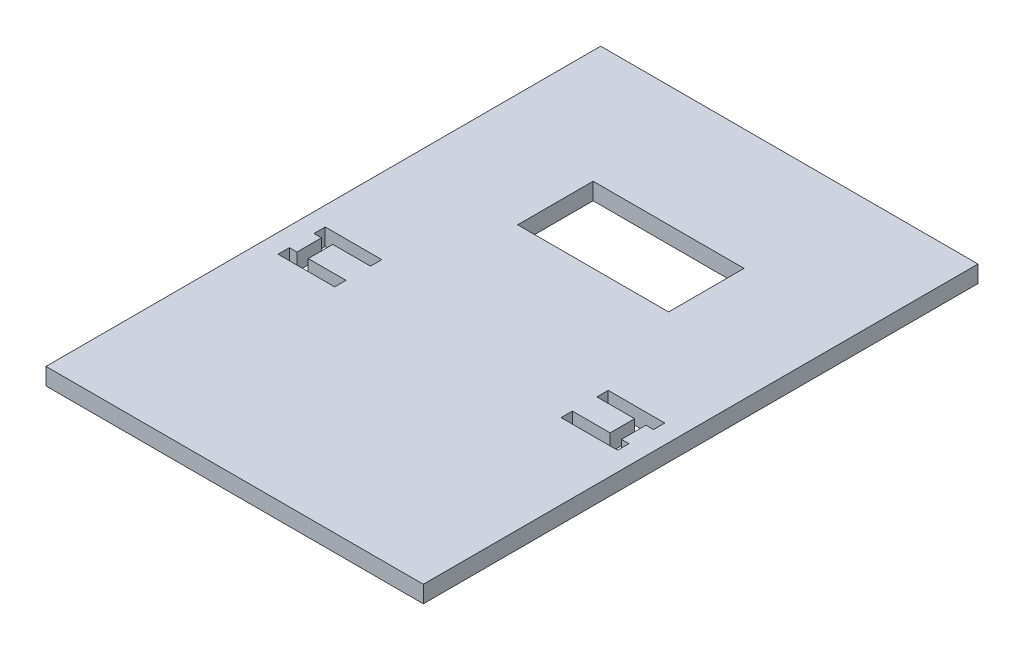
ISO-10303-21;
HEADER;
FILE_DESCRIPTION(('STEP AP214'),'2;1');
FILE_NAME('part.step','',(''),(''),'','','');
FILE_SCHEMA(('AUTOMOTIVE_DESIGN { 1 0 10303 214 1 1 1 1 }'));
ENDSEC;
DATA;
#1=APPLICATION_CONTEXT('core data for automotive mechanical design processes');
#2=APPLICATION_PROTOCOL_DEFINITION('international standard','automotive_design',2000,#1);
#3=PRODUCT_CONTEXT('',#1,'mechanical');
#4=PRODUCT('Part','Part','',(#3));
#5=PRODUCT_RELATED_PRODUCT_CATEGORY('part','',(#4));
#6=PRODUCT_DEFINITION_FORMATION('','',#4);
#7=PRODUCT_DEFINITION_CONTEXT('part definition',#1,'design');
#8=PRODUCT_DEFINITION('design','',#6,#7);
#9=PRODUCT_DEFINITION_SHAPE('','',#8);
#10=(LENGTH_UNIT() NAMED_UNIT(*) SI_UNIT(.MILLI.,.METRE.));
#11=(NAMED_UNIT(*) PLANE_ANGLE_UNIT() SI_UNIT($,.RADIAN.));
#12=(NAMED_UNIT(*) SI_UNIT($,.STERADIAN.) SOLID_ANGLE_UNIT());
#13=UNCERTAINTY_MEASURE_WITH_UNIT(LENGTH_MEASURE(1.E-05),#10,'distance_accuracy_value','');
#14=(GEOMETRIC_REPRESENTATION_CONTEXT(3) GLOBAL_UNCERTAINTY_ASSIGNED_CONTEXT((#13)) GLOBAL_UNIT_ASSIGNED_CONTEXT((#10,
#11,#12)) REPRESENTATION_CONTEXT('',''));
#15=CARTESIAN_POINT('',(0.,0.,0.));
#16=DIRECTION('',(0.,0.,1.));
#17=DIRECTION('',(1.,0.,0.));
#18=AXIS2_PLACEMENT_3D('',#15,#16,#17);
#19=CARTESIAN_POINT('',(0.,4.5,0.));
#20=DIRECTION('',(0.,-1.,0.));
#21=DIRECTION('',(0.,0.,-1.));
#22=AXIS2_PLACEMENT_3D('',#19,#20,#21);
#23=PLANE('',#22);
#24=DIRECTION('',(-1.,0.,0.));
#25=VECTOR('',#24,1.);
#26=CARTESIAN_POINT('',(-20.,4.5,-39.0292439198747));
#27=LINE('',#26,#25);
#28=CARTESIAN_POINT('',(20.,4.5,-39.0292439198747));
#29=VERTEX_POINT('',#28);
#30=CARTESIAN_POINT('',(-20.,4.5,-39.0292439198747));
#31=VERTEX_POINT('',#30);
#32=EDGE_CURVE('E340',#29,#31,#27,.T.);
#33=ORIENTED_EDGE('',*,*,#32,.F.);
#34=DIRECTION('',(0.,0.,-1.));
#35=VECTOR('',#34,1.);
#36=CARTESIAN_POINT('',(20.,4.5,-39.0292439198747));
#37=LINE('',#36,#35);
#38=CARTESIAN_POINT('',(20.,4.5,-19.0292439198747));
#39=VERTEX_POINT('',#38);
#40=EDGE_CURVE('E348',#39,#29,#37,.T.);
#41=ORIENTED_EDGE('',*,*,#40,.F.);
#42=DIRECTION('',(1.,0.,0.));
#43=VECTOR('',#42,1.);
#44=CARTESIAN_POINT('',(20.,4.5,-19.0292439198747));
#45=LINE('',#44,#43);
#46=CARTESIAN_POINT('',(-20.,4.5,-19.0292439198747));
#47=VERTEX_POINT('',#46);
#48=EDGE_CURVE('E345',#47,#39,#45,.T.);
#49=ORIENTED_EDGE('',*,*,#48,.F.);
#50=DIRECTION('',(0.,0.,1.));
#51=VECTOR('',#50,1.);
#52=CARTESIAN_POINT('',(-20.,4.5,-19.0292439198747));
#53=LINE('',#52,#51);
#54=EDGE_CURVE('E342',#31,#47,#53,.T.);
#55=ORIENTED_EDGE('',*,*,#54,.F.);
#56=EDGE_LOOP('',(#33,#41,#49,#55));
#57=FACE_BOUND('',#56,.T.);
#58=DIRECTION('',(0.,0.,-1.));
#59=VECTOR('',#58,1.);
#60=CARTESIAN_POINT('',(50.,4.5,-71.0292439198747));
#61=LINE('',#60,#59);
#62=CARTESIAN_POINT('',(50.,4.5,75.9707560801253));
#63=VERTEX_POINT('',#62);
#64=CARTESIAN_POINT('',(50.,4.5,-71.0292439198747));
#65=VERTEX_POINT('',#64);
#66=EDGE_CURVE('E458',#63,#65,#61,.T.);
#67=ORIENTED_EDGE('',*,*,#66,.T.);
#68=DIRECTION('',(-1.,0.,0.));
#69=VECTOR('',#68,1.);
#70=CARTESIAN_POINT('',(50.,4.5,-71.0292439198747));
#71=LINE('',#70,#69);
#72=CARTESIAN_POINT('',(-50.,4.5,-71.0292439198747));
#73=VERTEX_POINT('',#72);
#74=EDGE_CURVE('E461',#65,#73,#71,.T.);
#75=ORIENTED_EDGE('',*,*,#74,.T.);
#76=DIRECTION('',(0.,0.,1.));
#77=VECTOR('',#76,1.);
#78=CARTESIAN_POINT('',(-50.,4.5,75.9707560801253));
#79=LINE('',#78,#77);
#80=CARTESIAN_POINT('',(-50.,4.5,75.9707560801253));
#81=VERTEX_POINT('',#80);
#82=EDGE_CURVE('E464',#73,#81,#79,.T.);
#83=ORIENTED_EDGE('',*,*,#82,.T.);
#84=DIRECTION('',(1.,0.,0.));
#85=VECTOR('',#84,1.);
#86=CARTESIAN_POINT('',(50.,4.5,75.9707560801253));
#87=LINE('',#86,#85);
#88=EDGE_CURVE('E466',#81,#63,#87,.T.);
#89=ORIENTED_EDGE('',*,*,#88,.T.);
#90=EDGE_LOOP('',(#67,#75,#83,#89));
#91=FACE_BOUND('',#90,.T.);
#92=DIRECTION('',(0.,0.,1.));
#93=VECTOR('',#92,1.);
#94=CARTESIAN_POINT('',(-45.,4.5,9.97075608012532));
#95=LINE('',#94,#93);
#96=CARTESIAN_POINT('',(-45.,4.5,6.97075608012532));
#97=VERTEX_POINT('',#96);
#98=CARTESIAN_POINT('',(-45.,4.5,9.97075608012532));
#99=VERTEX_POINT('',#98);
#100=EDGE_CURVE('E371',#97,#99,#95,.T.);
#101=ORIENTED_EDGE('',*,*,#100,.F.);
#102=DIRECTION('',(-1.,0.,0.));
#103=VECTOR('',#102,1.);
#104=CARTESIAN_POINT('',(-45.,4.5,6.97075608012532));
#105=LINE('',#104,#103);
#106=CARTESIAN_POINT('',(-30.,4.5,6.97075608012532));
#107=VERTEX_POINT('',#106);
#108=EDGE_CURVE('E395',#107,#97,#105,.T.);
#109=ORIENTED_EDGE('',*,*,#108,.F.);
#110=DIRECTION('',(0.,0.,-1.));
#111=VECTOR('',#110,1.);
#112=CARTESIAN_POINT('',(-30.,4.5,6.97075608012532));
#113=LINE('',#112,#111);
#114=CARTESIAN_POINT('',(-30.,4.5,9.97075608012532));
#115=VERTEX_POINT('',#114);
#116=EDGE_CURVE('E392',#115,#107,#113,.T.);
#117=ORIENTED_EDGE('',*,*,#116,.F.);
#118=DIRECTION('',(1.,0.,0.));
#119=VECTOR('',#118,1.);
#120=CARTESIAN_POINT('',(-30.,4.5,9.97075608012532));
#121=LINE('',#120,#119);
#122=CARTESIAN_POINT('',(-40.,4.5,9.97075608012532));
#123=VERTEX_POINT('',#122);
#124=EDGE_CURVE('E390',#123,#115,#121,.T.);
#125=ORIENTED_EDGE('',*,*,#124,.F.);
#126=DIRECTION('',(0.,0.,-1.));
#127=VECTOR('',#126,1.);
#128=CARTESIAN_POINT('',(-40.,4.5,9.97075608012532));
#129=LINE('',#128,#127);
#130=CARTESIAN_POINT('',(-40.,4.5,16.4707560801253));
#131=VERTEX_POINT('',#130);
#132=EDGE_CURVE('E388',#131,#123,#129,.T.);
#133=ORIENTED_EDGE('',*,*,#132,.F.);
#134=DIRECTION('',(-1.,0.,0.));
#135=VECTOR('',#134,1.);
#136=CARTESIAN_POINT('',(-40.,4.5,16.4707560801253));
#137=LINE('',#136,#135);
#138=CARTESIAN_POINT('',(-30.,4.5,16.4707560801253));
#139=VERTEX_POINT('',#138);
#140=EDGE_CURVE('E386',#139,#131,#137,.T.);
#141=ORIENTED_EDGE('',*,*,#140,.F.);
#142=DIRECTION('',(0.,0.,-1.));
#143=VECTOR('',#142,1.);
#144=CARTESIAN_POINT('',(-30.,4.5,16.4707560801253));
#145=LINE('',#144,#143);
#146=CARTESIAN_POINT('',(-30.,4.5,19.4707560801253));
#147=VERTEX_POINT('',#146);
#148=EDGE_CURVE('E384',#147,#139,#145,.T.);
#149=ORIENTED_EDGE('',*,*,#148,.F.);
#150=DIRECTION('',(1.,0.,0.));
#151=VECTOR('',#150,1.);
#152=CARTESIAN_POINT('',(-30.,4.5,19.4707560801253));
#153=LINE('',#152,#151);
#154=CARTESIAN_POINT('',(-45.,4.5,19.4707560801253));
#155=VERTEX_POINT('',#154);
#156=EDGE_CURVE('E382',#155,#147,#153,.T.);
#157=ORIENTED_EDGE('',*,*,#156,.F.);
#158=DIRECTION('',(0.,0.,1.));
#159=VECTOR('',#158,1.);
#160=CARTESIAN_POINT('',(-45.,4.5,19.4707560801253));
#161=LINE('',#160,#159);
#162=CARTESIAN_POINT('',(-44.9999999999999,4.5,16.4707560801253));
#163=VERTEX_POINT('',#162);
#164=EDGE_CURVE('E380',#163,#155,#161,.T.);
#165=ORIENTED_EDGE('',*,*,#164,.F.);
#166=DIRECTION('',(-1.,0.,0.));
#167=VECTOR('',#166,1.);
#168=CARTESIAN_POINT('',(-44.9999999999999,4.5,16.4707560801253));
#169=LINE('',#168,#167);
#170=CARTESIAN_POINT('',(-43.,4.5,16.4707560801253));
#171=VERTEX_POINT('',#170);
#172=EDGE_CURVE('E378',#171,#163,#169,.T.);
#173=ORIENTED_EDGE('',*,*,#172,.F.);
#174=DIRECTION('',(0.,0.,1.));
#175=VECTOR('',#174,1.);
#176=CARTESIAN_POINT('',(-43.,4.5,16.4707560801253));
#177=LINE('',#176,#175);
#178=CARTESIAN_POINT('',(-43.,4.5,9.97075608012532));
#179=VERTEX_POINT('',#178);
#180=EDGE_CURVE('E376',#179,#171,#177,.T.);
#181=ORIENTED_EDGE('',*,*,#180,.F.);
#182=DIRECTION('',(1.,0.,0.));
#183=VECTOR('',#182,1.);
#184=CARTESIAN_POINT('',(-43.,4.5,9.97075608012532));
#185=LINE('',#184,#183);
#186=EDGE_CURVE('E373',#99,#179,#185,.T.);
#187=ORIENTED_EDGE('',*,*,#186,.F.);
#188=EDGE_LOOP('',(#101,#109,#117,#125,#133,#141,#149,#157,#165,#173,#181,#187));
#189=FACE_BOUND('',#188,.T.);
#190=DIRECTION('',(0.,0.,-1.));
#191=VECTOR('',#190,1.);
#192=CARTESIAN_POINT('',(43.,4.5,16.4707560801253));
#193=LINE('',#192,#191);
#194=CARTESIAN_POINT('',(43.,4.5,16.4707560801253));
#195=VERTEX_POINT('',#194);
#196=CARTESIAN_POINT('',(43.,4.5,9.97075608012532));
#197=VERTEX_POINT('',#196);
#198=EDGE_CURVE('E247',#195,#197,#193,.T.);
#199=ORIENTED_EDGE('',*,*,#198,.F.);
#200=DIRECTION('',(-1.,0.,0.));
#201=VECTOR('',#200,1.);
#202=CARTESIAN_POINT('',(45.,4.5,16.4707560801253));
#203=LINE('',#202,#201);
#204=CARTESIAN_POINT('',(45.,4.5,16.4707560801253));
#205=VERTEX_POINT('',#204);
#206=EDGE_CURVE('E288',#205,#195,#203,.T.);
#207=ORIENTED_EDGE('',*,*,#206,.F.);
#208=DIRECTION('',(0.,0.,-1.));
#209=VECTOR('',#208,1.);
#210=CARTESIAN_POINT('',(45.,4.5,19.4707560801253));
#211=LINE('',#210,#209);
#212=CARTESIAN_POINT('',(45.,4.5,19.4707560801253));
#213=VERTEX_POINT('',#212);
#214=EDGE_CURVE('E286',#213,#205,#211,.T.);
#215=ORIENTED_EDGE('',*,*,#214,.F.);
#216=DIRECTION('',(1.,0.,0.));
#217=VECTOR('',#216,1.);
#218=CARTESIAN_POINT('',(30.,4.5,19.4707560801253));
#219=LINE('',#218,#217);
#220=CARTESIAN_POINT('',(30.,4.5,19.4707560801253));
#221=VERTEX_POINT('',#220);
#222=EDGE_CURVE('E284',#221,#213,#219,.T.);
#223=ORIENTED_EDGE('',*,*,#222,.F.);
#224=DIRECTION('',(0.,0.,1.));
#225=VECTOR('',#224,1.);
#226=CARTESIAN_POINT('',(30.,4.5,16.4707560801253));
#227=LINE('',#226,#225);
#228=CARTESIAN_POINT('',(30.,4.5,16.4707560801253));
#229=VERTEX_POINT('',#228);
#230=EDGE_CURVE('E282',#229,#221,#227,.T.);
#231=ORIENTED_EDGE('',*,*,#230,.F.);
#232=DIRECTION('',(-1.,0.,0.));
#233=VECTOR('',#232,1.);
#234=CARTESIAN_POINT('',(40.,4.5,16.4707560801253));
#235=LINE('',#234,#233);
#236=CARTESIAN_POINT('',(40.,4.5,16.4707560801253));
#237=VERTEX_POINT('',#236);
#238=EDGE_CURVE('E280',#237,#229,#235,.T.);
#239=ORIENTED_EDGE('',*,*,#238,.F.);
#240=DIRECTION('',(0.,0.,1.));
#241=VECTOR('',#240,1.);
#242=CARTESIAN_POINT('',(40.,4.5,9.97075608012532));
#243=LINE('',#242,#241);
#244=CARTESIAN_POINT('',(40.,4.5,9.97075608012532));
#245=VERTEX_POINT('',#244);
#246=EDGE_CURVE('E278',#245,#237,#243,.T.);
#247=ORIENTED_EDGE('',*,*,#246,.F.);
#248=DIRECTION('',(1.,0.,0.));
#249=VECTOR('',#248,1.);
#250=CARTESIAN_POINT('',(30.,4.5,9.97075608012532));
#251=LINE('',#250,#249);
#252=CARTESIAN_POINT('',(30.,4.5,9.97075608012532));
#253=VERTEX_POINT('',#252);
#254=EDGE_CURVE('E276',#253,#245,#251,.T.);
#255=ORIENTED_EDGE('',*,*,#254,.F.);
#256=DIRECTION('',(0.,0.,1.));
#257=VECTOR('',#256,1.);
#258=CARTESIAN_POINT('',(30.,4.5,6.97075608012532));
#259=LINE('',#258,#257);
#260=CARTESIAN_POINT('',(30.,4.5,6.97075608012532));
#261=VERTEX_POINT('',#260);
#262=EDGE_CURVE('E274',#261,#253,#259,.T.);
#263=ORIENTED_EDGE('',*,*,#262,.F.);
#264=DIRECTION('',(-1.,0.,0.));
#265=VECTOR('',#264,1.);
#266=CARTESIAN_POINT('',(45.,4.5,6.97075608012532));
#267=LINE('',#266,#265);
#268=CARTESIAN_POINT('',(45.,4.5,6.97075608012532));
#269=VERTEX_POINT('',#268);
#270=EDGE_CURVE('E270',#269,#261,#267,.T.);
#271=ORIENTED_EDGE('',*,*,#270,.F.);
#272=DIRECTION('',(0.,0.,-1.));
#273=VECTOR('',#272,1.);
#274=CARTESIAN_POINT('',(45.,4.5,9.97075608012532));
#275=LINE('',#274,#273);
#276=CARTESIAN_POINT('',(45.,4.5,9.97075608012532));
#277=VERTEX_POINT('',#276);
#278=EDGE_CURVE('E268',#277,#269,#275,.T.);
#279=ORIENTED_EDGE('',*,*,#278,.F.);
#280=DIRECTION('',(1.,0.,0.));
#281=VECTOR('',#280,1.);
#282=CARTESIAN_POINT('',(43.,4.5,9.97075608012532));
#283=LINE('',#282,#281);
#284=EDGE_CURVE('E255',#197,#277,#283,.T.);
#285=ORIENTED_EDGE('',*,*,#284,.F.);
#286=EDGE_LOOP('',(#199,#207,#215,#223,#231,#239,#247,#255,#263,#271,#279,#285));
#287=FACE_BOUND('',#286,.T.);
#288=ADVANCED_FACE('F38',(#57,#91,#189,#287),#23,.F.);
#289=CARTESIAN_POINT('',(0.,0.,0.));
#290=DIRECTION('',(0.,-1.,0.));
#291=DIRECTION('',(0.,0.,-1.));
#292=AXIS2_PLACEMENT_3D('',#289,#290,#291);
#293=PLANE('',#292);
#294=DIRECTION('',(0.,0.,-1.));
#295=VECTOR('',#294,1.);
#296=CARTESIAN_POINT('',(50.,0.,-71.0292439198747));
#297=LINE('',#296,#295);
#298=CARTESIAN_POINT('',(50.,0.,75.9707560801253));
#299=VERTEX_POINT('',#298);
#300=CARTESIAN_POINT('',(50.,0.,-71.0292439198747));
#301=VERTEX_POINT('',#300);
#302=EDGE_CURVE('E457',#299,#301,#297,.T.);
#303=ORIENTED_EDGE('',*,*,#302,.F.);
#304=DIRECTION('',(1.,0.,0.));
#305=VECTOR('',#304,1.);
#306=CARTESIAN_POINT('',(50.,0.,75.9707560801253));
#307=LINE('',#306,#305);
#308=CARTESIAN_POINT('',(-50.,0.,75.9707560801253));
#309=VERTEX_POINT('',#308);
#310=EDGE_CURVE('E462',#309,#299,#307,.T.);
#311=ORIENTED_EDGE('',*,*,#310,.F.);
#312=DIRECTION('',(0.,0.,1.));
#313=VECTOR('',#312,1.);
#314=CARTESIAN_POINT('',(-50.,0.,75.9707560801253));
#315=LINE('',#314,#313);
#316=CARTESIAN_POINT('',(-50.,0.,-71.0292439198747));
#317=VERTEX_POINT('',#316);
#318=EDGE_CURVE('E473',#317,#309,#315,.T.);
#319=ORIENTED_EDGE('',*,*,#318,.F.);
#320=DIRECTION('',(-1.,0.,0.));
#321=VECTOR('',#320,1.);
#322=CARTESIAN_POINT('',(50.,0.,-71.0292439198747));
#323=LINE('',#322,#321);
#324=EDGE_CURVE('E471',#301,#317,#323,.T.);
#325=ORIENTED_EDGE('',*,*,#324,.F.);
#326=EDGE_LOOP('',(#303,#311,#319,#325));
#327=FACE_BOUND('',#326,.T.);
#328=DIRECTION('',(-1.,0.,0.));
#329=VECTOR('',#328,1.);
#330=CARTESIAN_POINT('',(-45.,0.,6.97075608012532));
#331=LINE('',#330,#329);
#332=CARTESIAN_POINT('',(-30.,0.,6.97075608012532));
#333=VERTEX_POINT('',#332);
#334=CARTESIAN_POINT('',(-45.,0.,6.97075608012532));
#335=VERTEX_POINT('',#334);
#336=EDGE_CURVE('E374',#333,#335,#331,.T.);
#337=ORIENTED_EDGE('',*,*,#336,.T.);
#338=DIRECTION('',(0.,0.,1.));
#339=VECTOR('',#338,1.);
#340=CARTESIAN_POINT('',(-45.,0.,9.97075608012532));
#341=LINE('',#340,#339);
#342=CARTESIAN_POINT('',(-45.,0.,9.97075608012532));
#343=VERTEX_POINT('',#342);
#344=EDGE_CURVE('E370',#335,#343,#341,.T.);
#345=ORIENTED_EDGE('',*,*,#344,.T.);
#346=DIRECTION('',(1.,0.,0.));
#347=VECTOR('',#346,1.);
#348=CARTESIAN_POINT('',(-43.,0.,9.97075608012532));
#349=LINE('',#348,#347);
#350=CARTESIAN_POINT('',(-43.,0.,9.97075608012532));
#351=VERTEX_POINT('',#350);
#352=EDGE_CURVE('E400',#343,#351,#349,.T.);
#353=ORIENTED_EDGE('',*,*,#352,.T.);
#354=DIRECTION('',(0.,0.,1.));
#355=VECTOR('',#354,1.);
#356=CARTESIAN_POINT('',(-43.,0.,16.4707560801253));
#357=LINE('',#356,#355);
#358=CARTESIAN_POINT('',(-43.,0.,16.4707560801253));
#359=VERTEX_POINT('',#358);
#360=EDGE_CURVE('E403',#351,#359,#357,.T.);
#361=ORIENTED_EDGE('',*,*,#360,.T.);
#362=DIRECTION('',(-1.,0.,0.));
#363=VECTOR('',#362,1.);
#364=CARTESIAN_POINT('',(-44.9999999999999,0.,16.4707560801253));
#365=LINE('',#364,#363);
#366=CARTESIAN_POINT('',(-44.9999999999999,0.,16.4707560801253));
#367=VERTEX_POINT('',#366);
#368=EDGE_CURVE('E406',#359,#367,#365,.T.);
#369=ORIENTED_EDGE('',*,*,#368,.T.);
#370=DIRECTION('',(0.,0.,1.));
#371=VECTOR('',#370,1.);
#372=CARTESIAN_POINT('',(-45.,0.,19.4707560801253));
#373=LINE('',#372,#371);
#374=CARTESIAN_POINT('',(-45.,0.,19.4707560801253));
#375=VERTEX_POINT('',#374);
#376=EDGE_CURVE('E409',#367,#375,#373,.T.);
#377=ORIENTED_EDGE('',*,*,#376,.T.);
#378=DIRECTION('',(1.,0.,0.));
#379=VECTOR('',#378,1.);
#380=CARTESIAN_POINT('',(-30.,0.,19.4707560801253));
#381=LINE('',#380,#379);
#382=CARTESIAN_POINT('',(-30.,0.,19.4707560801253));
#383=VERTEX_POINT('',#382);
#384=EDGE_CURVE('E412',#375,#383,#381,.T.);
#385=ORIENTED_EDGE('',*,*,#384,.T.);
#386=DIRECTION('',(0.,0.,-1.));
#387=VECTOR('',#386,1.);
#388=CARTESIAN_POINT('',(-30.,0.,16.4707560801253));
#389=LINE('',#388,#387);
#390=CARTESIAN_POINT('',(-30.,0.,16.4707560801253));
#391=VERTEX_POINT('',#390);
#392=EDGE_CURVE('E415',#383,#391,#389,.T.);
#393=ORIENTED_EDGE('',*,*,#392,.T.);
#394=DIRECTION('',(-1.,0.,0.));
#395=VECTOR('',#394,1.);
#396=CARTESIAN_POINT('',(-40.,0.,16.4707560801253));
#397=LINE('',#396,#395);
#398=CARTESIAN_POINT('',(-40.,0.,16.4707560801253));
#399=VERTEX_POINT('',#398);
#400=EDGE_CURVE('E418',#391,#399,#397,.T.);
#401=ORIENTED_EDGE('',*,*,#400,.T.);
#402=DIRECTION('',(0.,0.,-1.));
#403=VECTOR('',#402,1.);
#404=CARTESIAN_POINT('',(-40.,0.,9.97075608012532));
#405=LINE('',#404,#403);
#406=CARTESIAN_POINT('',(-40.,0.,9.97075608012532));
#407=VERTEX_POINT('',#406);
#408=EDGE_CURVE('E421',#399,#407,#405,.T.);
#409=ORIENTED_EDGE('',*,*,#408,.T.);
#410=DIRECTION('',(1.,0.,0.));
#411=VECTOR('',#410,1.);
#412=CARTESIAN_POINT('',(-30.,0.,9.97075608012532));
#413=LINE('',#412,#411);
#414=CARTESIAN_POINT('',(-30.,0.,9.97075608012532));
#415=VERTEX_POINT('',#414);
#416=EDGE_CURVE('E424',#407,#415,#413,.T.);
#417=ORIENTED_EDGE('',*,*,#416,.T.);
#418=DIRECTION('',(0.,0.,-1.));
#419=VECTOR('',#418,1.);
#420=CARTESIAN_POINT('',(-30.,0.,6.97075608012532));
#421=LINE('',#420,#419);
#422=EDGE_CURVE('E427',#415,#333,#421,.T.);
#423=ORIENTED_EDGE('',*,*,#422,.T.);
#424=EDGE_LOOP('',(#337,#345,#353,#361,#369,#377,#385,#393,#401,#409,#417,#423));
#425=FACE_BOUND('',#424,.T.);
#426=DIRECTION('',(0.,0.,-1.));
#427=VECTOR('',#426,1.);
#428=CARTESIAN_POINT('',(20.,0.,-39.0292439198747));
#429=LINE('',#428,#427);
#430=CARTESIAN_POINT('',(20.,0.,-19.0292439198747));
#431=VERTEX_POINT('',#430);
#432=CARTESIAN_POINT('',(20.,0.,-39.0292439198747));
#433=VERTEX_POINT('',#432);
#434=EDGE_CURVE('E343',#431,#433,#429,.T.);
#435=ORIENTED_EDGE('',*,*,#434,.T.);
#436=DIRECTION('',(-1.,0.,0.));
#437=VECTOR('',#436,1.);
#438=CARTESIAN_POINT('',(-20.,0.,-39.0292439198747));
#439=LINE('',#438,#437);
#440=CARTESIAN_POINT('',(-20.,0.,-39.0292439198747));
#441=VERTEX_POINT('',#440);
#442=EDGE_CURVE('E263',#433,#441,#439,.T.);
#443=ORIENTED_EDGE('',*,*,#442,.T.);
#444=DIRECTION('',(0.,0.,1.));
#445=VECTOR('',#444,1.);
#446=CARTESIAN_POINT('',(-20.,0.,-19.0292439198747));
#447=LINE('',#446,#445);
#448=CARTESIAN_POINT('',(-20.,0.,-19.0292439198747));
#449=VERTEX_POINT('',#448);
#450=EDGE_CURVE('E353',#441,#449,#447,.T.);
#451=ORIENTED_EDGE('',*,*,#450,.T.);
#452=DIRECTION('',(1.,0.,0.));
#453=VECTOR('',#452,1.);
#454=CARTESIAN_POINT('',(20.,0.,-19.0292439198747));
#455=LINE('',#454,#453);
#456=EDGE_CURVE('E356',#449,#431,#455,.T.);
#457=ORIENTED_EDGE('',*,*,#456,.T.);
#458=EDGE_LOOP('',(#435,#443,#451,#457));
#459=FACE_BOUND('',#458,.T.);
#460=DIRECTION('',(-1.,0.,0.));
#461=VECTOR('',#460,1.);
#462=CARTESIAN_POINT('',(45.,0.,16.4707560801253));
#463=LINE('',#462,#461);
#464=CARTESIAN_POINT('',(45.,0.,16.4707560801253));
#465=VERTEX_POINT('',#464);
#466=CARTESIAN_POINT('',(43.,0.,16.4707560801253));
#467=VERTEX_POINT('',#466);
#468=EDGE_CURVE('E256',#465,#467,#463,.T.);
#469=ORIENTED_EDGE('',*,*,#468,.T.);
#470=DIRECTION('',(0.,0.,-1.));
#471=VECTOR('',#470,1.);
#472=CARTESIAN_POINT('',(43.,0.,16.4707560801253));
#473=LINE('',#472,#471);
#474=CARTESIAN_POINT('',(43.,0.,9.97075608012532));
#475=VERTEX_POINT('',#474);
#476=EDGE_CURVE('E61',#467,#475,#473,.T.);
#477=ORIENTED_EDGE('',*,*,#476,.T.);
#478=DIRECTION('',(1.,0.,0.));
#479=VECTOR('',#478,1.);
#480=CARTESIAN_POINT('',(43.,0.,9.97075608012532));
#481=LINE('',#480,#479);
#482=CARTESIAN_POINT('',(45.,0.,9.97075608012532));
#483=VERTEX_POINT('',#482);
#484=EDGE_CURVE('E262',#475,#483,#481,.T.);
#485=ORIENTED_EDGE('',*,*,#484,.T.);
#486=DIRECTION('',(0.,0.,-1.));
#487=VECTOR('',#486,1.);
#488=CARTESIAN_POINT('',(45.,0.,9.97075608012532));
#489=LINE('',#488,#487);
#490=CARTESIAN_POINT('',(45.,0.,6.97075608012532));
#491=VERTEX_POINT('',#490);
#492=EDGE_CURVE('E292',#483,#491,#489,.T.);
#493=ORIENTED_EDGE('',*,*,#492,.T.);
#494=DIRECTION('',(-1.,0.,0.));
#495=VECTOR('',#494,1.);
#496=CARTESIAN_POINT('',(45.,0.,6.97075608012532));
#497=LINE('',#496,#495);
#498=CARTESIAN_POINT('',(30.,0.,6.97075608012532));
#499=VERTEX_POINT('',#498);
#500=EDGE_CURVE('E295',#491,#499,#497,.T.);
#501=ORIENTED_EDGE('',*,*,#500,.T.);
#502=DIRECTION('',(0.,0.,1.));
#503=VECTOR('',#502,1.);
#504=CARTESIAN_POINT('',(30.,0.,6.97075608012532));
#505=LINE('',#504,#503);
#506=CARTESIAN_POINT('',(30.,0.,9.97075608012532));
#507=VERTEX_POINT('',#506);
#508=EDGE_CURVE('E298',#499,#507,#505,.T.);
#509=ORIENTED_EDGE('',*,*,#508,.T.);
#510=DIRECTION('',(1.,0.,0.));
#511=VECTOR('',#510,1.);
#512=CARTESIAN_POINT('',(30.,0.,9.97075608012532));
#513=LINE('',#512,#511);
#514=CARTESIAN_POINT('',(40.,0.,9.97075608012532));
#515=VERTEX_POINT('',#514);
#516=EDGE_CURVE('E301',#507,#515,#513,.T.);
#517=ORIENTED_EDGE('',*,*,#516,.T.);
#518=DIRECTION('',(0.,0.,1.));
#519=VECTOR('',#518,1.);
#520=CARTESIAN_POINT('',(40.,0.,9.97075608012532));
#521=LINE('',#520,#519);
#522=CARTESIAN_POINT('',(40.,0.,16.4707560801253));
#523=VERTEX_POINT('',#522);
#524=EDGE_CURVE('E304',#515,#523,#521,.T.);
#525=ORIENTED_EDGE('',*,*,#524,.T.);
#526=DIRECTION('',(-1.,0.,0.));
#527=VECTOR('',#526,1.);
#528=CARTESIAN_POINT('',(40.,0.,16.4707560801253));
#529=LINE('',#528,#527);
#530=CARTESIAN_POINT('',(30.,0.,16.4707560801253));
#531=VERTEX_POINT('',#530);
#532=EDGE_CURVE('E307',#523,#531,#529,.T.);
#533=ORIENTED_EDGE('',*,*,#532,.T.);
#534=DIRECTION('',(0.,0.,1.));
#535=VECTOR('',#534,1.);
#536=CARTESIAN_POINT('',(30.,0.,16.4707560801253));
#537=LINE('',#536,#535);
#538=CARTESIAN_POINT('',(30.,0.,19.4707560801253));
#539=VERTEX_POINT('',#538);
#540=EDGE_CURVE('E310',#531,#539,#537,.T.);
#541=ORIENTED_EDGE('',*,*,#540,.T.);
#542=DIRECTION('',(1.,0.,0.));
#543=VECTOR('',#542,1.);
#544=CARTESIAN_POINT('',(30.,0.,19.4707560801253));
#545=LINE('',#544,#543);
#546=CARTESIAN_POINT('',(45.,0.,19.4707560801253));
#547=VERTEX_POINT('',#546);
#548=EDGE_CURVE('E313',#539,#547,#545,.T.);
#549=ORIENTED_EDGE('',*,*,#548,.T.);
#550=DIRECTION('',(0.,0.,-1.));
#551=VECTOR('',#550,1.);
#552=CARTESIAN_POINT('',(45.,0.,19.4707560801253));
#553=LINE('',#552,#551);
#554=EDGE_CURVE('E316',#547,#465,#553,.T.);
#555=ORIENTED_EDGE('',*,*,#554,.T.);
#556=EDGE_LOOP('',(#469,#477,#485,#493,#501,#509,#517,#525,#533,#541,#549,#555));
#557=FACE_BOUND('',#556,.T.);
#558=ADVANCED_FACE('F491',(#327,#425,#459,#557),#293,.T.);
#559=CARTESIAN_POINT('',(50.,4.5,-71.0292439198747));
#560=DIRECTION('',(-1.,0.,0.));
#561=DIRECTION('',(0.,0.,1.));
#562=AXIS2_PLACEMENT_3D('',#559,#560,#561);
#563=PLANE('',#562);
#564=ORIENTED_EDGE('',*,*,#302,.T.);
#565=DIRECTION('',(0.,-1.,0.));
#566=VECTOR('',#565,1.);
#567=CARTESIAN_POINT('',(50.,4.5,-71.0292439198747));
#568=LINE('',#567,#566);
#569=EDGE_CURVE('E11',#65,#301,#568,.T.);
#570=ORIENTED_EDGE('',*,*,#569,.F.);
#571=ORIENTED_EDGE('',*,*,#66,.F.);
#572=DIRECTION('',(0.,-1.,0.));
#573=VECTOR('',#572,1.);
#574=CARTESIAN_POINT('',(50.,4.5,75.9707560801253));
#575=LINE('',#574,#573);
#576=EDGE_CURVE('E468',#63,#299,#575,.T.);
#577=ORIENTED_EDGE('',*,*,#576,.T.);
#578=EDGE_LOOP('',(#564,#570,#571,#577));
#579=FACE_BOUND('',#578,.T.);
#580=ADVANCED_FACE('F40',(#579),#563,.F.);
#581=CARTESIAN_POINT('',(50.,4.5,-71.0292439198747));
#582=DIRECTION('',(0.,0.,1.));
#583=DIRECTION('',(1.,0.,0.));
#584=AXIS2_PLACEMENT_3D('',#581,#582,#583);
#585=PLANE('',#584);
#586=ORIENTED_EDGE('',*,*,#324,.T.);
#587=DIRECTION('',(0.,-1.,0.));
#588=VECTOR('',#587,1.);
#589=CARTESIAN_POINT('',(-50.,4.5,-71.0292439198747));
#590=LINE('',#589,#588);
#591=EDGE_CURVE('E46',#73,#317,#590,.T.);
#592=ORIENTED_EDGE('',*,*,#591,.F.);
#593=ORIENTED_EDGE('',*,*,#74,.F.);
#594=ORIENTED_EDGE('',*,*,#569,.T.);
#595=EDGE_LOOP('',(#586,#592,#593,#594));
#596=FACE_BOUND('',#595,.T.);
#597=ADVANCED_FACE('F502',(#596),#585,.F.);
#598=CARTESIAN_POINT('',(-50.,4.5,75.9707560801253));
#599=DIRECTION('',(1.,0.,0.));
#600=DIRECTION('',(0.,0.,-1.));
#601=AXIS2_PLACEMENT_3D('',#598,#599,#600);
#602=PLANE('',#601);
#603=ORIENTED_EDGE('',*,*,#318,.T.);
#604=DIRECTION('',(0.,-1.,0.));
#605=VECTOR('',#604,1.);
#606=CARTESIAN_POINT('',(-50.,4.5,75.9707560801253));
#607=LINE('',#606,#605);
#608=EDGE_CURVE('E478',#81,#309,#607,.T.);
#609=ORIENTED_EDGE('',*,*,#608,.F.);
#610=ORIENTED_EDGE('',*,*,#82,.F.);
#611=ORIENTED_EDGE('',*,*,#591,.T.);
#612=EDGE_LOOP('',(#603,#609,#610,#611));
#613=FACE_BOUND('',#612,.T.);
#614=ADVANCED_FACE('F485',(#613),#602,.F.);
#615=CARTESIAN_POINT('',(50.,4.5,75.9707560801253));
#616=DIRECTION('',(0.,0.,-1.));
#617=DIRECTION('',(-1.,0.,0.));
#618=AXIS2_PLACEMENT_3D('',#615,#616,#617);
#619=PLANE('',#618);
#620=ORIENTED_EDGE('',*,*,#310,.T.);
#621=ORIENTED_EDGE('',*,*,#576,.F.);
#622=ORIENTED_EDGE('',*,*,#88,.F.);
#623=ORIENTED_EDGE('',*,*,#608,.T.);
#624=EDGE_LOOP('',(#620,#621,#622,#623));
#625=FACE_BOUND('',#624,.T.);
#626=ADVANCED_FACE('F495',(#625),#619,.F.);
#627=CARTESIAN_POINT('',(-45.,4.5,9.97075608012532));
#628=DIRECTION('',(1.,0.,0.));
#629=DIRECTION('',(0.,0.,-1.));
#630=AXIS2_PLACEMENT_3D('',#627,#628,#629);
#631=PLANE('',#630);
#632=ORIENTED_EDGE('',*,*,#344,.F.);
#633=DIRECTION('',(0.,-1.,0.));
#634=VECTOR('',#633,1.);
#635=CARTESIAN_POINT('',(-45.,4.5,6.97075608012532));
#636=LINE('',#635,#634);
#637=EDGE_CURVE('E397',#97,#335,#636,.T.);
#638=ORIENTED_EDGE('',*,*,#637,.F.);
#639=ORIENTED_EDGE('',*,*,#100,.T.);
#640=DIRECTION('',(0.,-1.,0.));
#641=VECTOR('',#640,1.);
#642=CARTESIAN_POINT('',(-45.,4.5,9.97075608012532));
#643=LINE('',#642,#641);
#644=EDGE_CURVE('E454',#99,#343,#643,.T.);
#645=ORIENTED_EDGE('',*,*,#644,.T.);
#646=EDGE_LOOP('',(#632,#638,#639,#645));
#647=FACE_BOUND('',#646,.T.);
#648=ADVANCED_FACE('F518',(#647),#631,.T.);
#649=CARTESIAN_POINT('',(-43.,4.5,9.97075608012532));
#650=DIRECTION('',(0.,0.,-1.));
#651=DIRECTION('',(-1.,0.,0.));
#652=AXIS2_PLACEMENT_3D('',#649,#650,#651);
#653=PLANE('',#652);
#654=ORIENTED_EDGE('',*,*,#352,.F.);
#655=ORIENTED_EDGE('',*,*,#644,.F.);
#656=ORIENTED_EDGE('',*,*,#186,.T.);
#657=DIRECTION('',(0.,-1.,0.));
#658=VECTOR('',#657,1.);
#659=CARTESIAN_POINT('',(-43.,4.5,9.97075608012532));
#660=LINE('',#659,#658);
#661=EDGE_CURVE('E452',#179,#351,#660,.T.);
#662=ORIENTED_EDGE('',*,*,#661,.T.);
#663=EDGE_LOOP('',(#654,#655,#656,#662));
#664=FACE_BOUND('',#663,.T.);
#665=ADVANCED_FACE('F525',(#664),#653,.T.);
#666=CARTESIAN_POINT('',(-43.,4.5,16.4707560801253));
#667=DIRECTION('',(1.,0.,0.));
#668=DIRECTION('',(0.,0.,-1.));
#669=AXIS2_PLACEMENT_3D('',#666,#667,#668);
#670=PLANE('',#669);
#671=ORIENTED_EDGE('',*,*,#360,.F.);
#672=ORIENTED_EDGE('',*,*,#661,.F.);
#673=ORIENTED_EDGE('',*,*,#180,.T.);
#674=DIRECTION('',(0.,-1.,0.));
#675=VECTOR('',#674,1.);
#676=CARTESIAN_POINT('',(-43.,4.5,16.4707560801253));
#677=LINE('',#676,#675);
#678=EDGE_CURVE('E450',#171,#359,#677,.T.);
#679=ORIENTED_EDGE('',*,*,#678,.T.);
#680=EDGE_LOOP('',(#671,#672,#673,#679));
#681=FACE_BOUND('',#680,.T.);
#682=ADVANCED_FACE('F530',(#681),#670,.T.);
#683=CARTESIAN_POINT('',(-44.9999999999999,4.5,16.4707560801253));
#684=DIRECTION('',(0.,0.,1.));
#685=DIRECTION('',(1.,0.,0.));
#686=AXIS2_PLACEMENT_3D('',#683,#684,#685);
#687=PLANE('',#686);
#688=ORIENTED_EDGE('',*,*,#368,.F.);
#689=ORIENTED_EDGE('',*,*,#678,.F.);
#690=ORIENTED_EDGE('',*,*,#172,.T.);
#691=DIRECTION('',(0.,-1.,0.));
#692=VECTOR('',#691,1.);
#693=CARTESIAN_POINT('',(-44.9999999999999,4.5,16.4707560801253));
#694=LINE('',#693,#692);
#695=EDGE_CURVE('E448',#163,#367,#694,.T.);
#696=ORIENTED_EDGE('',*,*,#695,.T.);
#697=EDGE_LOOP('',(#688,#689,#690,#696));
#698=FACE_BOUND('',#697,.T.);
#699=ADVANCED_FACE('F556',(#698),#687,.T.);
#700=CARTESIAN_POINT('',(-45.,4.5,19.4707560801253));
#701=DIRECTION('',(1.,0.,0.));
#702=DIRECTION('',(0.,0.,-1.));
#703=AXIS2_PLACEMENT_3D('',#700,#701,#702);
#704=PLANE('',#703);
#705=ORIENTED_EDGE('',*,*,#376,.F.);
#706=ORIENTED_EDGE('',*,*,#695,.F.);
#707=ORIENTED_EDGE('',*,*,#164,.T.);
#708=DIRECTION('',(0.,-1.,0.));
#709=VECTOR('',#708,1.);
#710=CARTESIAN_POINT('',(-45.,4.5,19.4707560801253));
#711=LINE('',#710,#709);
#712=EDGE_CURVE('E446',#155,#375,#711,.T.);
#713=ORIENTED_EDGE('',*,*,#712,.T.);
#714=EDGE_LOOP('',(#705,#706,#707,#713));
#715=FACE_BOUND('',#714,.T.);
#716=ADVANCED_FACE('F561',(#715),#704,.T.);
#717=CARTESIAN_POINT('',(-30.,4.5,19.4707560801253));
#718=DIRECTION('',(0.,0.,-1.));
#719=DIRECTION('',(-1.,0.,0.));
#720=AXIS2_PLACEMENT_3D('',#717,#718,#719);
#721=PLANE('',#720);
#722=ORIENTED_EDGE('',*,*,#384,.F.);
#723=ORIENTED_EDGE('',*,*,#712,.F.);
#724=ORIENTED_EDGE('',*,*,#156,.T.);
#725=DIRECTION('',(0.,-1.,0.));
#726=VECTOR('',#725,1.);
#727=CARTESIAN_POINT('',(-30.,4.5,19.4707560801253));
#728=LINE('',#727,#726);
#729=EDGE_CURVE('E444',#147,#383,#728,.T.);
#730=ORIENTED_EDGE('',*,*,#729,.T.);
#731=EDGE_LOOP('',(#722,#723,#724,#730));
#732=FACE_BOUND('',#731,.T.);
#733=ADVANCED_FACE('F566',(#732),#721,.T.);
#734=CARTESIAN_POINT('',(-30.,4.5,16.4707560801253));
#735=DIRECTION('',(-1.,0.,0.));
#736=DIRECTION('',(0.,0.,1.));
#737=AXIS2_PLACEMENT_3D('',#734,#735,#736);
#738=PLANE('',#737);
#739=ORIENTED_EDGE('',*,*,#392,.F.);
#740=ORIENTED_EDGE('',*,*,#729,.F.);
#741=ORIENTED_EDGE('',*,*,#148,.T.);
#742=DIRECTION('',(0.,-1.,0.));
#743=VECTOR('',#742,1.);
#744=CARTESIAN_POINT('',(-30.,4.5,16.4707560801253));
#745=LINE('',#744,#743);
#746=EDGE_CURVE('E442',#139,#391,#745,.T.);
#747=ORIENTED_EDGE('',*,*,#746,.T.);
#748=EDGE_LOOP('',(#739,#740,#741,#747));
#749=FACE_BOUND('',#748,.T.);
#750=ADVANCED_FACE('F571',(#749),#738,.T.);
#751=CARTESIAN_POINT('',(-40.,4.5,16.4707560801253));
#752=DIRECTION('',(0.,0.,1.));
#753=DIRECTION('',(1.,0.,0.));
#754=AXIS2_PLACEMENT_3D('',#751,#752,#753);
#755=PLANE('',#754);
#756=ORIENTED_EDGE('',*,*,#400,.F.);
#757=ORIENTED_EDGE('',*,*,#746,.F.);
#758=ORIENTED_EDGE('',*,*,#140,.T.);
#759=DIRECTION('',(0.,-1.,0.));
#760=VECTOR('',#759,1.);
#761=CARTESIAN_POINT('',(-40.,4.5,16.4707560801253));
#762=LINE('',#761,#760);
#763=EDGE_CURVE('E440',#131,#399,#762,.T.);
#764=ORIENTED_EDGE('',*,*,#763,.T.);
#765=EDGE_LOOP('',(#756,#757,#758,#764));
#766=FACE_BOUND('',#765,.T.);
#767=ADVANCED_FACE('F576',(#766),#755,.T.);
#768=CARTESIAN_POINT('',(-40.,4.5,9.97075608012532));
#769=DIRECTION('',(-1.,0.,0.));
#770=DIRECTION('',(0.,0.,1.));
#771=AXIS2_PLACEMENT_3D('',#768,#769,#770);
#772=PLANE('',#771);
#773=ORIENTED_EDGE('',*,*,#408,.F.);
#774=ORIENTED_EDGE('',*,*,#763,.F.);
#775=ORIENTED_EDGE('',*,*,#132,.T.);
#776=DIRECTION('',(0.,-1.,0.));
#777=VECTOR('',#776,1.);
#778=CARTESIAN_POINT('',(-40.,4.5,9.97075608012532));
#779=LINE('',#778,#777);
#780=EDGE_CURVE('E438',#123,#407,#779,.T.);
#781=ORIENTED_EDGE('',*,*,#780,.T.);
#782=EDGE_LOOP('',(#773,#774,#775,#781));
#783=FACE_BOUND('',#782,.T.);
#784=ADVANCED_FACE('F580',(#783),#772,.T.);
#785=CARTESIAN_POINT('',(-30.,4.5,9.97075608012532));
#786=DIRECTION('',(0.,0.,-1.));
#787=DIRECTION('',(-1.,0.,0.));
#788=AXIS2_PLACEMENT_3D('',#785,#786,#787);
#789=PLANE('',#788);
#790=ORIENTED_EDGE('',*,*,#416,.F.);
#791=ORIENTED_EDGE('',*,*,#780,.F.);
#792=ORIENTED_EDGE('',*,*,#124,.T.);
#793=DIRECTION('',(0.,-1.,0.));
#794=VECTOR('',#793,1.);
#795=CARTESIAN_POINT('',(-30.,4.5,9.97075608012532));
#796=LINE('',#795,#794);
#797=EDGE_CURVE('E436',#115,#415,#796,.T.);
#798=ORIENTED_EDGE('',*,*,#797,.T.);
#799=EDGE_LOOP('',(#790,#791,#792,#798));
#800=FACE_BOUND('',#799,.T.);
#801=ADVANCED_FACE('F584',(#800),#789,.T.);
#802=CARTESIAN_POINT('',(-30.,4.5,6.97075608012532));
#803=DIRECTION('',(-1.,0.,0.));
#804=DIRECTION('',(0.,0.,1.));
#805=AXIS2_PLACEMENT_3D('',#802,#803,#804);
#806=PLANE('',#805);
#807=ORIENTED_EDGE('',*,*,#422,.F.);
#808=ORIENTED_EDGE('',*,*,#797,.F.);
#809=ORIENTED_EDGE('',*,*,#116,.T.);
#810=DIRECTION('',(0.,-1.,0.));
#811=VECTOR('',#810,1.);
#812=CARTESIAN_POINT('',(-30.,4.5,6.97075608012532));
#813=LINE('',#812,#811);
#814=EDGE_CURVE('E434',#107,#333,#813,.T.);
#815=ORIENTED_EDGE('',*,*,#814,.T.);
#816=EDGE_LOOP('',(#807,#808,#809,#815));
#817=FACE_BOUND('',#816,.T.);
#818=ADVANCED_FACE('F544',(#817),#806,.T.);
#819=CARTESIAN_POINT('',(-45.,4.5,6.97075608012532));
#820=DIRECTION('',(0.,0.,1.));
#821=DIRECTION('',(1.,0.,0.));
#822=AXIS2_PLACEMENT_3D('',#819,#820,#821);
#823=PLANE('',#822);
#824=ORIENTED_EDGE('',*,*,#336,.F.);
#825=ORIENTED_EDGE('',*,*,#814,.F.);
#826=ORIENTED_EDGE('',*,*,#108,.T.);
#827=ORIENTED_EDGE('',*,*,#637,.T.);
#828=EDGE_LOOP('',(#824,#825,#826,#827));
#829=FACE_BOUND('',#828,.T.);
#830=ADVANCED_FACE('F537',(#829),#823,.T.);
#831=CARTESIAN_POINT('',(-20.,4.5,-39.0292439198747));
#832=DIRECTION('',(0.,0.,1.));
#833=DIRECTION('',(1.,0.,0.));
#834=AXIS2_PLACEMENT_3D('',#831,#832,#833);
#835=PLANE('',#834);
#836=ORIENTED_EDGE('',*,*,#442,.F.);
#837=DIRECTION('',(0.,-1.,0.));
#838=VECTOR('',#837,1.);
#839=CARTESIAN_POINT('',(20.,4.5,-39.0292439198747));
#840=LINE('',#839,#838);
#841=EDGE_CURVE('E350',#29,#433,#840,.T.);
#842=ORIENTED_EDGE('',*,*,#841,.F.);
#843=ORIENTED_EDGE('',*,*,#32,.T.);
#844=DIRECTION('',(0.,-1.,0.));
#845=VECTOR('',#844,1.);
#846=CARTESIAN_POINT('',(-20.,4.5,-39.0292439198747));
#847=LINE('',#846,#845);
#848=EDGE_CURVE('E367',#31,#441,#847,.T.);
#849=ORIENTED_EDGE('',*,*,#848,.T.);
#850=EDGE_LOOP('',(#836,#842,#843,#849));
#851=FACE_BOUND('',#850,.T.);
#852=ADVANCED_FACE('F656',(#851),#835,.T.);
#853=CARTESIAN_POINT('',(-20.,4.5,-19.0292439198747));
#854=DIRECTION('',(1.,0.,0.));
#855=DIRECTION('',(0.,0.,-1.));
#856=AXIS2_PLACEMENT_3D('',#853,#854,#855);
#857=PLANE('',#856);
#858=ORIENTED_EDGE('',*,*,#450,.F.);
#859=ORIENTED_EDGE('',*,*,#848,.F.);
#860=ORIENTED_EDGE('',*,*,#54,.T.);
#861=DIRECTION('',(0.,-1.,0.));
#862=VECTOR('',#861,1.);
#863=CARTESIAN_POINT('',(-20.,4.5,-19.0292439198747));
#864=LINE('',#863,#862);
#865=EDGE_CURVE('E365',#47,#449,#864,.T.);
#866=ORIENTED_EDGE('',*,*,#865,.T.);
#867=EDGE_LOOP('',(#858,#859,#860,#866));
#868=FACE_BOUND('',#867,.T.);
#869=ADVANCED_FACE('F665',(#868),#857,.T.);
#870=CARTESIAN_POINT('',(20.,4.5,-19.0292439198747));
#871=DIRECTION('',(0.,0.,-1.));
#872=DIRECTION('',(-1.,0.,0.));
#873=AXIS2_PLACEMENT_3D('',#870,#871,#872);
#874=PLANE('',#873);
#875=ORIENTED_EDGE('',*,*,#456,.F.);
#876=ORIENTED_EDGE('',*,*,#865,.F.);
#877=ORIENTED_EDGE('',*,*,#48,.T.);
#878=DIRECTION('',(0.,-1.,0.));
#879=VECTOR('',#878,1.);
#880=CARTESIAN_POINT('',(20.,4.5,-19.0292439198747));
#881=LINE('',#880,#879);
#882=EDGE_CURVE('E363',#39,#431,#881,.T.);
#883=ORIENTED_EDGE('',*,*,#882,.T.);
#884=EDGE_LOOP('',(#875,#876,#877,#883));
#885=FACE_BOUND('',#884,.T.);
#886=ADVANCED_FACE('F676',(#885),#874,.T.);
#887=CARTESIAN_POINT('',(20.,4.5,-39.0292439198747));
#888=DIRECTION('',(-1.,0.,0.));
#889=DIRECTION('',(0.,0.,1.));
#890=AXIS2_PLACEMENT_3D('',#887,#888,#889);
#891=PLANE('',#890);
#892=ORIENTED_EDGE('',*,*,#434,.F.);
#893=ORIENTED_EDGE('',*,*,#882,.F.);
#894=ORIENTED_EDGE('',*,*,#40,.T.);
#895=ORIENTED_EDGE('',*,*,#841,.T.);
#896=EDGE_LOOP('',(#892,#893,#894,#895));
#897=FACE_BOUND('',#896,.T.);
#898=ADVANCED_FACE('F687',(#897),#891,.T.);
#899=CARTESIAN_POINT('',(43.,4.5,16.4707560801253));
#900=DIRECTION('',(-1.,0.,0.));
#901=DIRECTION('',(0.,0.,1.));
#902=AXIS2_PLACEMENT_3D('',#899,#900,#901);
#903=PLANE('',#902);
#904=ORIENTED_EDGE('',*,*,#476,.F.);
#905=DIRECTION('',(0.,-1.,0.));
#906=VECTOR('',#905,1.);
#907=CARTESIAN_POINT('',(43.,4.5,16.4707560801253));
#908=LINE('',#907,#906);
#909=EDGE_CURVE('E251',#195,#467,#908,.T.);
#910=ORIENTED_EDGE('',*,*,#909,.F.);
#911=ORIENTED_EDGE('',*,*,#198,.T.);
#912=DIRECTION('',(0.,-1.,0.));
#913=VECTOR('',#912,1.);
#914=CARTESIAN_POINT('',(43.,4.5,9.97075608012532));
#915=LINE('',#914,#913);
#916=EDGE_CURVE('E250',#197,#475,#915,.T.);
#917=ORIENTED_EDGE('',*,*,#916,.T.);
#918=EDGE_LOOP('',(#904,#910,#911,#917));
#919=FACE_BOUND('',#918,.T.);
#920=ADVANCED_FACE('F249',(#919),#903,.T.);
#921=CARTESIAN_POINT('',(43.,4.5,9.97075608012532));
#922=DIRECTION('',(0.,0.,-1.));
#923=DIRECTION('',(-1.,0.,0.));
#924=AXIS2_PLACEMENT_3D('',#921,#922,#923);
#925=PLANE('',#924);
#926=ORIENTED_EDGE('',*,*,#484,.F.);
#927=ORIENTED_EDGE('',*,*,#916,.F.);
#928=ORIENTED_EDGE('',*,*,#284,.T.);
#929=DIRECTION('',(0.,-1.,0.));
#930=VECTOR('',#929,1.);
#931=CARTESIAN_POINT('',(45.,4.5,9.97075608012532));
#932=LINE('',#931,#930);
#933=EDGE_CURVE('E264',#277,#483,#932,.T.);
#934=ORIENTED_EDGE('',*,*,#933,.T.);
#935=EDGE_LOOP('',(#926,#927,#928,#934));
#936=FACE_BOUND('',#935,.T.);
#937=ADVANCED_FACE('F259',(#936),#925,.T.);
#938=CARTESIAN_POINT('',(45.,4.5,9.97075608012532));
#939=DIRECTION('',(-1.,0.,0.));
#940=DIRECTION('',(0.,0.,1.));
#941=AXIS2_PLACEMENT_3D('',#938,#939,#940);
#942=PLANE('',#941);
#943=ORIENTED_EDGE('',*,*,#492,.F.);
#944=ORIENTED_EDGE('',*,*,#933,.F.);
#945=ORIENTED_EDGE('',*,*,#278,.T.);
#946=DIRECTION('',(0.,-1.,0.));
#947=VECTOR('',#946,1.);
#948=CARTESIAN_POINT('',(45.,4.5,6.97075608012532));
#949=LINE('',#948,#947);
#950=EDGE_CURVE('E337',#269,#491,#949,.T.);
#951=ORIENTED_EDGE('',*,*,#950,.T.);
#952=EDGE_LOOP('',(#943,#944,#945,#951));
#953=FACE_BOUND('',#952,.T.);
#954=ADVANCED_FACE('F717',(#953),#942,.T.);
#955=CARTESIAN_POINT('',(45.,4.5,6.97075608012532));
#956=DIRECTION('',(0.,0.,1.));
#957=DIRECTION('',(1.,0.,0.));
#958=AXIS2_PLACEMENT_3D('',#955,#956,#957);
#959=PLANE('',#958);
#960=ORIENTED_EDGE('',*,*,#500,.F.);
#961=ORIENTED_EDGE('',*,*,#950,.F.);
#962=ORIENTED_EDGE('',*,*,#270,.T.);
#963=DIRECTION('',(0.,-1.,0.));
#964=VECTOR('',#963,1.);
#965=CARTESIAN_POINT('',(30.,4.5,6.97075608012532));
#966=LINE('',#965,#964);
#967=EDGE_CURVE('E335',#261,#499,#966,.T.);
#968=ORIENTED_EDGE('',*,*,#967,.T.);
#969=EDGE_LOOP('',(#960,#961,#962,#968));
#970=FACE_BOUND('',#969,.T.);
#971=ADVANCED_FACE('F727',(#970),#959,.T.);
#972=CARTESIAN_POINT('',(30.,4.5,6.97075608012532));
#973=DIRECTION('',(1.,0.,0.));
#974=DIRECTION('',(0.,0.,-1.));
#975=AXIS2_PLACEMENT_3D('',#972,#973,#974);
#976=PLANE('',#975);
#977=ORIENTED_EDGE('',*,*,#508,.F.);
#978=ORIENTED_EDGE('',*,*,#967,.F.);
#979=ORIENTED_EDGE('',*,*,#262,.T.);
#980=DIRECTION('',(0.,-1.,0.));
#981=VECTOR('',#980,1.);
#982=CARTESIAN_POINT('',(30.,4.5,9.97075608012532));
#983=LINE('',#982,#981);
#984=EDGE_CURVE('E333',#253,#507,#983,.T.);
#985=ORIENTED_EDGE('',*,*,#984,.T.);
#986=EDGE_LOOP('',(#977,#978,#979,#985));
#987=FACE_BOUND('',#986,.T.);
#988=ADVANCED_FACE('F738',(#987),#976,.T.);
#989=CARTESIAN_POINT('',(30.,4.5,9.97075608012532));
#990=DIRECTION('',(0.,0.,-1.));
#991=DIRECTION('',(-1.,0.,0.));
#992=AXIS2_PLACEMENT_3D('',#989,#990,#991);
#993=PLANE('',#992);
#994=ORIENTED_EDGE('',*,*,#516,.F.);
#995=ORIENTED_EDGE('',*,*,#984,.F.);
#996=ORIENTED_EDGE('',*,*,#254,.T.);
#997=DIRECTION('',(0.,-1.,0.));
#998=VECTOR('',#997,1.);
#999=CARTESIAN_POINT('',(40.,4.5,9.97075608012532));
#1000=LINE('',#999,#998);
#1001=EDGE_CURVE('E331',#245,#515,#1000,.T.);
#1002=ORIENTED_EDGE('',*,*,#1001,.T.);
#1003=EDGE_LOOP('',(#994,#995,#996,#1002));
#1004=FACE_BOUND('',#1003,.T.);
#1005=ADVANCED_FACE('F749',(#1004),#993,.T.);
#1006=CARTESIAN_POINT('',(40.,4.5,9.97075608012532));
#1007=DIRECTION('',(1.,0.,0.));
#1008=DIRECTION('',(0.,0.,-1.));
#1009=AXIS2_PLACEMENT_3D('',#1006,#1007,#1008);
#1010=PLANE('',#1009);
#1011=ORIENTED_EDGE('',*,*,#524,.F.);
#1012=ORIENTED_EDGE('',*,*,#1001,.F.);
#1013=ORIENTED_EDGE('',*,*,#246,.T.);
#1014=DIRECTION('',(0.,-1.,0.));
#1015=VECTOR('',#1014,1.);
#1016=CARTESIAN_POINT('',(40.,4.5,16.4707560801253));
#1017=LINE('',#1016,#1015);
#1018=EDGE_CURVE('E329',#237,#523,#1017,.T.);
#1019=ORIENTED_EDGE('',*,*,#1018,.T.);
#1020=EDGE_LOOP('',(#1011,#1012,#1013,#1019));
#1021=FACE_BOUND('',#1020,.T.);
#1022=ADVANCED_FACE('F760',(#1021),#1010,.T.);
#1023=CARTESIAN_POINT('',(40.,4.5,16.4707560801253));
#1024=DIRECTION('',(0.,0.,1.));
#1025=DIRECTION('',(1.,0.,0.));
#1026=AXIS2_PLACEMENT_3D('',#1023,#1024,#1025);
#1027=PLANE('',#1026);
#1028=ORIENTED_EDGE('',*,*,#532,.F.);
#1029=ORIENTED_EDGE('',*,*,#1018,.F.);
#1030=ORIENTED_EDGE('',*,*,#238,.T.);
#1031=DIRECTION('',(0.,-1.,0.));
#1032=VECTOR('',#1031,1.);
#1033=CARTESIAN_POINT('',(30.,4.5,16.4707560801253));
#1034=LINE('',#1033,#1032);
#1035=EDGE_CURVE('E327',#229,#531,#1034,.T.);
#1036=ORIENTED_EDGE('',*,*,#1035,.T.);
#1037=EDGE_LOOP('',(#1028,#1029,#1030,#1036));
#1038=FACE_BOUND('',#1037,.T.);
#1039=ADVANCED_FACE('F771',(#1038),#1027,.T.);
#1040=CARTESIAN_POINT('',(30.,4.5,16.4707560801253));
#1041=DIRECTION('',(1.,0.,0.));
#1042=DIRECTION('',(0.,0.,-1.));
#1043=AXIS2_PLACEMENT_3D('',#1040,#1041,#1042);
#1044=PLANE('',#1043);
#1045=ORIENTED_EDGE('',*,*,#540,.F.);
#1046=ORIENTED_EDGE('',*,*,#1035,.F.);
#1047=ORIENTED_EDGE('',*,*,#230,.T.);
#1048=DIRECTION('',(0.,-1.,0.));
#1049=VECTOR('',#1048,1.);
#1050=CARTESIAN_POINT('',(30.,4.5,19.4707560801253));
#1051=LINE('',#1050,#1049);
#1052=EDGE_CURVE('E325',#221,#539,#1051,.T.);
#1053=ORIENTED_EDGE('',*,*,#1052,.T.);
#1054=EDGE_LOOP('',(#1045,#1046,#1047,#1053));
#1055=FACE_BOUND('',#1054,.T.);
#1056=ADVANCED_FACE('F782',(#1055),#1044,.T.);
#1057=CARTESIAN_POINT('',(30.,4.5,19.4707560801253));
#1058=DIRECTION('',(0.,0.,-1.));
#1059=DIRECTION('',(-1.,0.,0.));
#1060=AXIS2_PLACEMENT_3D('',#1057,#1058,#1059);
#1061=PLANE('',#1060);
#1062=ORIENTED_EDGE('',*,*,#548,.F.);
#1063=ORIENTED_EDGE('',*,*,#1052,.F.);
#1064=ORIENTED_EDGE('',*,*,#222,.T.);
#1065=DIRECTION('',(0.,-1.,0.));
#1066=VECTOR('',#1065,1.);
#1067=CARTESIAN_POINT('',(45.,4.5,19.4707560801253));
#1068=LINE('',#1067,#1066);
#1069=EDGE_CURVE('E323',#213,#547,#1068,.T.);
#1070=ORIENTED_EDGE('',*,*,#1069,.T.);
#1071=EDGE_LOOP('',(#1062,#1063,#1064,#1070));
#1072=FACE_BOUND('',#1071,.T.);
#1073=ADVANCED_FACE('F793',(#1072),#1061,.T.);
#1074=CARTESIAN_POINT('',(45.,4.5,19.4707560801253));
#1075=DIRECTION('',(-1.,0.,0.));
#1076=DIRECTION('',(0.,0.,1.));
#1077=AXIS2_PLACEMENT_3D('',#1074,#1075,#1076);
#1078=PLANE('',#1077);
#1079=ORIENTED_EDGE('',*,*,#554,.F.);
#1080=ORIENTED_EDGE('',*,*,#1069,.F.);
#1081=ORIENTED_EDGE('',*,*,#214,.T.);
#1082=DIRECTION('',(0.,-1.,0.));
#1083=VECTOR('',#1082,1.);
#1084=CARTESIAN_POINT('',(45.,4.5,16.4707560801253));
#1085=LINE('',#1084,#1083);
#1086=EDGE_CURVE('E53',#205,#465,#1085,.T.);
#1087=ORIENTED_EDGE('',*,*,#1086,.T.);
#1088=EDGE_LOOP('',(#1079,#1080,#1081,#1087));
#1089=FACE_BOUND('',#1088,.T.);
#1090=ADVANCED_FACE('F804',(#1089),#1078,.T.);
#1091=CARTESIAN_POINT('',(45.,4.5,16.4707560801253));
#1092=DIRECTION('',(0.,0.,1.));
#1093=DIRECTION('',(1.,0.,0.));
#1094=AXIS2_PLACEMENT_3D('',#1091,#1092,#1093);
#1095=PLANE('',#1094);
#1096=ORIENTED_EDGE('',*,*,#468,.F.);
#1097=ORIENTED_EDGE('',*,*,#1086,.F.);
#1098=ORIENTED_EDGE('',*,*,#206,.T.);
#1099=ORIENTED_EDGE('',*,*,#909,.T.);
#1100=EDGE_LOOP('',(#1096,#1097,#1098,#1099));
#1101=FACE_BOUND('',#1100,.T.);
#1102=ADVANCED_FACE('F815',(#1101),#1095,.T.);
#1103=CLOSED_SHELL('',(#288,#558,#580,#597,#614,#626,#648,#665,#682,#699,#716,#733,#750,#767,
#784,#801,#818,#830,#852,#869,#886,#898,#920,#937,#954,#971,#988,#1005,#1022,#1039,#1056,#1073,
#1090,#1102));
#1104=MANIFOLD_SOLID_BREP('B2',#1103);
#1105=ADVANCED_BREP_SHAPE_REPRESENTATION('',(#18,#1104),#14);
#1106=SHAPE_DEFINITION_REPRESENTATION(#9,#1105);
ENDSEC;
END-ISO-10303-21;
